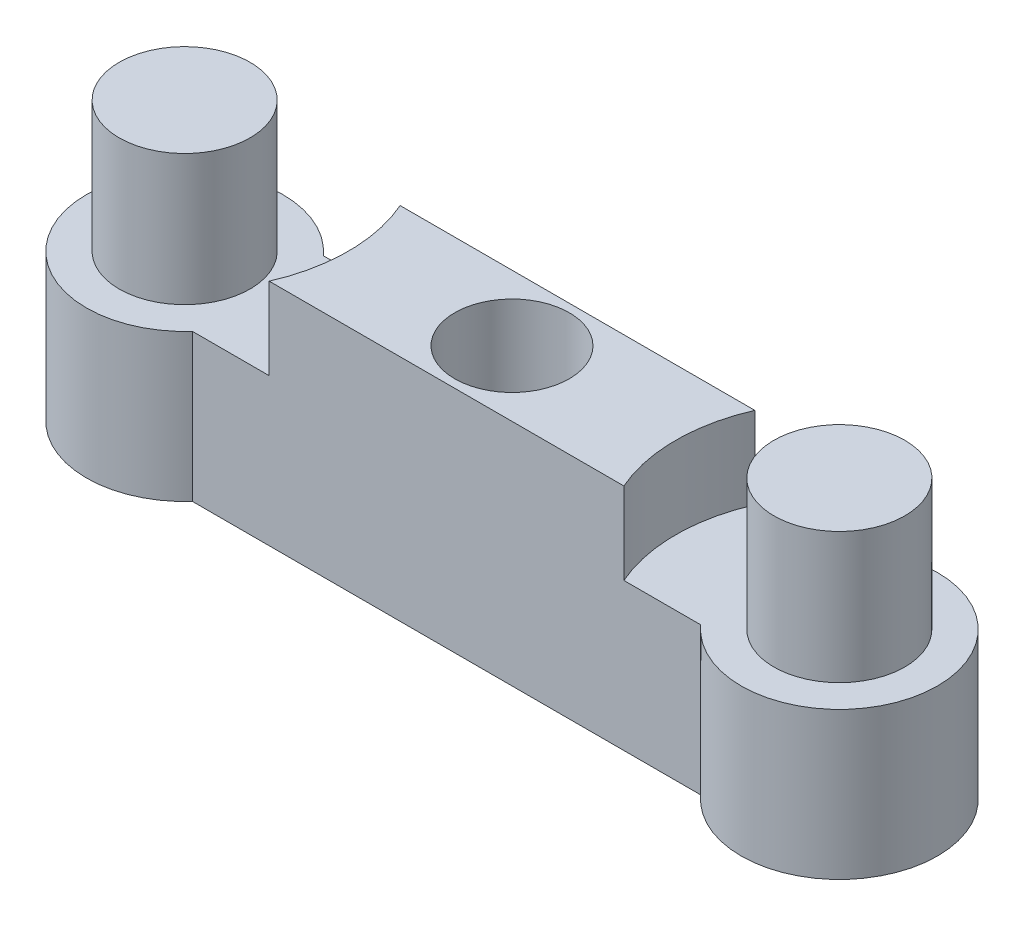
ISO-10303-21;
HEADER;
FILE_DESCRIPTION(('STEP AP214'),'2;1');
FILE_NAME('part.step','',(''),(''),'','','');
FILE_SCHEMA(('AUTOMOTIVE_DESIGN { 1 0 10303 214 1 1 1 1 }'));
ENDSEC;
DATA;
#1=APPLICATION_CONTEXT('core data for automotive mechanical design processes');
#2=APPLICATION_PROTOCOL_DEFINITION('international standard','automotive_design',2000,#1);
#3=PRODUCT_CONTEXT('',#1,'mechanical');
#4=PRODUCT('Part','Part','',(#3));
#5=PRODUCT_RELATED_PRODUCT_CATEGORY('part','',(#4));
#6=PRODUCT_DEFINITION_FORMATION('','',#4);
#7=PRODUCT_DEFINITION_CONTEXT('part definition',#1,'design');
#8=PRODUCT_DEFINITION('design','',#6,#7);
#9=PRODUCT_DEFINITION_SHAPE('','',#8);
#10=(LENGTH_UNIT() NAMED_UNIT(*) SI_UNIT(.MILLI.,.METRE.));
#11=(NAMED_UNIT(*) PLANE_ANGLE_UNIT() SI_UNIT($,.RADIAN.));
#12=(NAMED_UNIT(*) SI_UNIT($,.STERADIAN.) SOLID_ANGLE_UNIT());
#13=UNCERTAINTY_MEASURE_WITH_UNIT(LENGTH_MEASURE(1.E-05),#10,'distance_accuracy_value','');
#14=(GEOMETRIC_REPRESENTATION_CONTEXT(3) GLOBAL_UNCERTAINTY_ASSIGNED_CONTEXT((#13)) GLOBAL_UNIT_ASSIGNED_CONTEXT((#10,
#11,#12)) REPRESENTATION_CONTEXT('',''));
#15=CARTESIAN_POINT('',(0.,0.,0.));
#16=DIRECTION('',(0.,0.,1.));
#17=DIRECTION('',(1.,0.,0.));
#18=AXIS2_PLACEMENT_3D('',#15,#16,#17);
#19=CARTESIAN_POINT('',(7.76393202250021,9.,2.));
#20=DIRECTION('',(0.,0.,-1.));
#21=DIRECTION('',(-1.,0.,0.));
#22=AXIS2_PLACEMENT_3D('',#19,#20,#21);
#23=PLANE('',#22);
#24=DIRECTION('',(1.,0.,0.));
#25=VECTOR('',#24,1.);
#26=CARTESIAN_POINT('',(7.76393202250021,7.,2.));
#27=LINE('',#26,#25);
#28=CARTESIAN_POINT('',(-5.41742430504416,7.,2.));
#29=VERTEX_POINT('',#28);
#30=CARTESIAN_POINT('',(5.41742430504417,7.,2.));
#31=VERTEX_POINT('',#30);
#32=EDGE_CURVE('E105',#29,#31,#27,.T.);
#33=ORIENTED_EDGE('',*,*,#32,.F.);
#34=DIRECTION('',(0.,1.,0.));
#35=VECTOR('',#34,1.);
#36=CARTESIAN_POINT('',(-5.41742430504416,4.5,2.));
#37=LINE('',#36,#35);
#38=CARTESIAN_POINT('',(-5.41742430504416,4.5,2.));
#39=VERTEX_POINT('',#38);
#40=EDGE_CURVE('E114',#29,#39,#37,.F.);
#41=ORIENTED_EDGE('',*,*,#40,.T.);
#42=DIRECTION('',(1.,0.,0.));
#43=VECTOR('',#42,1.);
#44=CARTESIAN_POINT('',(7.76393202250021,4.5,2.));
#45=LINE('',#44,#43);
#46=CARTESIAN_POINT('',(-7.76393202250021,4.5,2.));
#47=VERTEX_POINT('',#46);
#48=EDGE_CURVE('E136',#47,#39,#45,.T.);
#49=ORIENTED_EDGE('',*,*,#48,.F.);
#50=DIRECTION('',(0.,-1.,0.));
#51=VECTOR('',#50,1.);
#52=CARTESIAN_POINT('',(-7.76393202250021,9.,2.));
#53=LINE('',#52,#51);
#54=CARTESIAN_POINT('',(-7.76393202250021,0.,2.));
#55=VERTEX_POINT('',#54);
#56=EDGE_CURVE('E153',#47,#55,#53,.T.);
#57=ORIENTED_EDGE('',*,*,#56,.T.);
#58=DIRECTION('',(1.,0.,0.));
#59=VECTOR('',#58,1.);
#60=CARTESIAN_POINT('',(7.76393202250021,0.,2.));
#61=LINE('',#60,#59);
#62=CARTESIAN_POINT('',(7.76393202250021,0.,2.));
#63=VERTEX_POINT('',#62);
#64=EDGE_CURVE('E140',#55,#63,#61,.T.);
#65=ORIENTED_EDGE('',*,*,#64,.T.);
#66=DIRECTION('',(0.,-1.,0.));
#67=VECTOR('',#66,1.);
#68=CARTESIAN_POINT('',(7.76393202250021,9.,2.));
#69=LINE('',#68,#67);
#70=CARTESIAN_POINT('',(7.76393202250021,4.5,2.));
#71=VERTEX_POINT('',#70);
#72=EDGE_CURVE('E151',#71,#63,#69,.T.);
#73=ORIENTED_EDGE('',*,*,#72,.F.);
#74=DIRECTION('',(-1.,0.,0.));
#75=VECTOR('',#74,1.);
#76=CARTESIAN_POINT('',(7.76393202250021,4.5,2.));
#77=LINE('',#76,#75);
#78=CARTESIAN_POINT('',(5.41742430504417,4.5,2.));
#79=VERTEX_POINT('',#78);
#80=EDGE_CURVE('E128',#71,#79,#77,.T.);
#81=ORIENTED_EDGE('',*,*,#80,.T.);
#82=DIRECTION('',(0.,1.,0.));
#83=VECTOR('',#82,1.);
#84=CARTESIAN_POINT('',(5.41742430504417,4.5,2.));
#85=LINE('',#84,#83);
#86=EDGE_CURVE('E117',#79,#31,#85,.T.);
#87=ORIENTED_EDGE('',*,*,#86,.T.);
#88=EDGE_LOOP('',(#33,#41,#49,#57,#65,#73,#81,#87));
#89=FACE_BOUND('',#88,.T.);
#90=ADVANCED_FACE('F36',(#89),#23,.F.);
#91=CARTESIAN_POINT('',(7.76393202250021,9.,-2.));
#92=DIRECTION('',(0.,0.,1.));
#93=DIRECTION('',(1.,0.,0.));
#94=AXIS2_PLACEMENT_3D('',#91,#92,#93);
#95=PLANE('',#94);
#96=DIRECTION('',(-1.,0.,0.));
#97=VECTOR('',#96,1.);
#98=CARTESIAN_POINT('',(7.76393202250021,7.,-2.));
#99=LINE('',#98,#97);
#100=CARTESIAN_POINT('',(5.41742430504416,7.,-2.));
#101=VERTEX_POINT('',#100);
#102=CARTESIAN_POINT('',(-5.41742430504416,7.,-2.));
#103=VERTEX_POINT('',#102);
#104=EDGE_CURVE('E53',#101,#103,#99,.T.);
#105=ORIENTED_EDGE('',*,*,#104,.F.);
#106=DIRECTION('',(0.,1.,0.));
#107=VECTOR('',#106,1.);
#108=CARTESIAN_POINT('',(5.41742430504416,4.5,-2.));
#109=LINE('',#108,#107);
#110=CARTESIAN_POINT('',(5.41742430504416,4.5,-2.));
#111=VERTEX_POINT('',#110);
#112=EDGE_CURVE('E183',#101,#111,#109,.F.);
#113=ORIENTED_EDGE('',*,*,#112,.T.);
#114=DIRECTION('',(1.,0.,0.));
#115=VECTOR('',#114,1.);
#116=CARTESIAN_POINT('',(7.76393202250021,4.5,-2.));
#117=LINE('',#116,#115);
#118=CARTESIAN_POINT('',(7.76393202250021,4.5,-2.));
#119=VERTEX_POINT('',#118);
#120=EDGE_CURVE('E155',#111,#119,#117,.T.);
#121=ORIENTED_EDGE('',*,*,#120,.T.);
#122=DIRECTION('',(0.,-1.,0.));
#123=VECTOR('',#122,1.);
#124=CARTESIAN_POINT('',(7.76393202250021,9.,-2.));
#125=LINE('',#124,#123);
#126=CARTESIAN_POINT('',(7.76393202250021,0.,-2.));
#127=VERTEX_POINT('',#126);
#128=EDGE_CURVE('E149',#119,#127,#125,.T.);
#129=ORIENTED_EDGE('',*,*,#128,.T.);
#130=DIRECTION('',(-1.,0.,0.));
#131=VECTOR('',#130,1.);
#132=CARTESIAN_POINT('',(7.76393202250021,0.,-2.));
#133=LINE('',#132,#131);
#134=CARTESIAN_POINT('',(-7.76393202250021,0.,-2.));
#135=VERTEX_POINT('',#134);
#136=EDGE_CURVE('E146',#127,#135,#133,.T.);
#137=ORIENTED_EDGE('',*,*,#136,.T.);
#138=DIRECTION('',(0.,-1.,0.));
#139=VECTOR('',#138,1.);
#140=CARTESIAN_POINT('',(-7.76393202250021,9.,-2.));
#141=LINE('',#140,#139);
#142=CARTESIAN_POINT('',(-7.76393202250021,4.5,-2.));
#143=VERTEX_POINT('',#142);
#144=EDGE_CURVE('E61',#143,#135,#141,.T.);
#145=ORIENTED_EDGE('',*,*,#144,.F.);
#146=DIRECTION('',(-1.,0.,0.));
#147=VECTOR('',#146,1.);
#148=CARTESIAN_POINT('',(7.76393202250021,4.5,-2.));
#149=LINE('',#148,#147);
#150=CARTESIAN_POINT('',(-5.41742430504416,4.5,-2.));
#151=VERTEX_POINT('',#150);
#152=EDGE_CURVE('E45',#151,#143,#149,.T.);
#153=ORIENTED_EDGE('',*,*,#152,.F.);
#154=DIRECTION('',(0.,1.,0.));
#155=VECTOR('',#154,1.);
#156=CARTESIAN_POINT('',(-5.41742430504416,4.5,-2.));
#157=LINE('',#156,#155);
#158=EDGE_CURVE('E125',#151,#103,#157,.T.);
#159=ORIENTED_EDGE('',*,*,#158,.T.);
#160=EDGE_LOOP('',(#105,#113,#121,#129,#137,#145,#153,#159));
#161=FACE_BOUND('',#160,.T.);
#162=ADVANCED_FACE('F189',(#161),#95,.F.);
#163=CARTESIAN_POINT('',(10.,4.5,0.));
#164=DIRECTION('',(0.,1.,0.));
#165=DIRECTION('',(0.,0.,1.));
#166=AXIS2_PLACEMENT_3D('',#163,#164,#165);
#167=CYLINDRICAL_SURFACE('',#166,5.);
#168=CARTESIAN_POINT('',(10.,7.,0.));
#169=DIRECTION('',(0.,1.,0.));
#170=DIRECTION('',(0.,0.,1.));
#171=AXIS2_PLACEMENT_3D('',#168,#169,#170);
#172=CIRCLE('',#171,5.);
#173=EDGE_CURVE('E118',#31,#101,#172,.F.);
#174=ORIENTED_EDGE('',*,*,#173,.F.);
#175=ORIENTED_EDGE('',*,*,#86,.F.);
#176=CARTESIAN_POINT('',(10.,4.5,0.));
#177=DIRECTION('',(0.,1.,0.));
#178=DIRECTION('',(0.,0.,-1.));
#179=AXIS2_PLACEMENT_3D('',#176,#177,#178);
#180=CIRCLE('',#179,5.);
#181=EDGE_CURVE('E179',#111,#79,#180,.T.);
#182=ORIENTED_EDGE('',*,*,#181,.F.);
#183=ORIENTED_EDGE('',*,*,#112,.F.);
#184=EDGE_LOOP('',(#174,#175,#182,#183));
#185=FACE_BOUND('',#184,.T.);
#186=ADVANCED_FACE('F195',(#185),#167,.F.);
#187=CARTESIAN_POINT('',(-10.,4.5,0.));
#188=DIRECTION('',(0.,1.,0.));
#189=DIRECTION('',(0.,0.,1.));
#190=AXIS2_PLACEMENT_3D('',#187,#188,#189);
#191=CYLINDRICAL_SURFACE('',#190,5.);
#192=CARTESIAN_POINT('',(-10.,7.,0.));
#193=DIRECTION('',(0.,1.,0.));
#194=DIRECTION('',(0.,0.,1.));
#195=AXIS2_PLACEMENT_3D('',#192,#193,#194);
#196=CIRCLE('',#195,5.);
#197=EDGE_CURVE('E102',#103,#29,#196,.F.);
#198=ORIENTED_EDGE('',*,*,#197,.F.);
#199=ORIENTED_EDGE('',*,*,#158,.F.);
#200=CARTESIAN_POINT('',(-10.,4.5,0.));
#201=DIRECTION('',(0.,1.,0.));
#202=DIRECTION('',(0.,0.,1.));
#203=AXIS2_PLACEMENT_3D('',#200,#201,#202);
#204=CIRCLE('',#203,5.);
#205=EDGE_CURVE('E123',#39,#151,#204,.T.);
#206=ORIENTED_EDGE('',*,*,#205,.F.);
#207=ORIENTED_EDGE('',*,*,#40,.F.);
#208=EDGE_LOOP('',(#198,#199,#206,#207));
#209=FACE_BOUND('',#208,.T.);
#210=ADVANCED_FACE('F121',(#209),#191,.F.);
#211=CARTESIAN_POINT('',(0.,2.,0.));
#212=DIRECTION('',(0.,1.,0.));
#213=DIRECTION('',(0.,0.,1.));
#214=AXIS2_PLACEMENT_3D('',#211,#212,#213);
#215=CYLINDRICAL_SURFACE('',#214,1.75);
#216=CARTESIAN_POINT('',(0.,2.,0.));
#217=DIRECTION('',(0.,1.,0.));
#218=DIRECTION('',(0.,0.,1.));
#219=AXIS2_PLACEMENT_3D('',#216,#217,#218);
#220=CIRCLE('',#219,1.75);
#221=CARTESIAN_POINT('',(0.,2.,1.75));
#222=VERTEX_POINT('',#221);
#223=EDGE_CURVE('E161',#222,#222,#220,.T.);
#224=ORIENTED_EDGE('',*,*,#223,.F.);
#225=EDGE_LOOP('',(#224));
#226=FACE_BOUND('',#225,.T.);
#227=CARTESIAN_POINT('',(0.,7.,0.));
#228=DIRECTION('',(0.,1.,0.));
#229=DIRECTION('',(0.,0.,1.));
#230=AXIS2_PLACEMENT_3D('',#227,#228,#229);
#231=CIRCLE('',#230,1.75);
#232=CARTESIAN_POINT('',(0.,7.,1.75));
#233=VERTEX_POINT('',#232);
#234=EDGE_CURVE('E40',#233,#233,#231,.F.);
#235=ORIENTED_EDGE('',*,*,#234,.F.);
#236=EDGE_LOOP('',(#235));
#237=FACE_BOUND('',#236,.T.);
#238=ADVANCED_FACE('F202',(#226,#237),#215,.F.);
#239=CARTESIAN_POINT('',(0.,0.,0.));
#240=DIRECTION('',(0.,1.,0.));
#241=DIRECTION('',(0.,0.,1.));
#242=AXIS2_PLACEMENT_3D('',#239,#240,#241);
#243=CYLINDRICAL_SURFACE('',#242,1.);
#244=CARTESIAN_POINT('',(0.,0.,0.));
#245=DIRECTION('',(0.,1.,0.));
#246=DIRECTION('',(0.,0.,1.));
#247=AXIS2_PLACEMENT_3D('',#244,#245,#246);
#248=CIRCLE('',#247,1.);
#249=CARTESIAN_POINT('',(0.,0.,1.));
#250=VERTEX_POINT('',#249);
#251=EDGE_CURVE('E160',#250,#250,#248,.T.);
#252=ORIENTED_EDGE('',*,*,#251,.F.);
#253=EDGE_LOOP('',(#252));
#254=FACE_BOUND('',#253,.T.);
#255=CARTESIAN_POINT('',(0.,2.,0.));
#256=DIRECTION('',(0.,1.,0.));
#257=DIRECTION('',(0.,0.,1.));
#258=AXIS2_PLACEMENT_3D('',#255,#256,#257);
#259=CIRCLE('',#258,1.);
#260=CARTESIAN_POINT('',(0.,2.,1.));
#261=VERTEX_POINT('',#260);
#262=EDGE_CURVE('E158',#261,#261,#259,.F.);
#263=ORIENTED_EDGE('',*,*,#262,.F.);
#264=EDGE_LOOP('',(#263));
#265=FACE_BOUND('',#264,.T.);
#266=ADVANCED_FACE('F256',(#254,#265),#243,.F.);
#267=CARTESIAN_POINT('',(-10.,9.,0.));
#268=DIRECTION('',(0.,-1.,0.));
#269=DIRECTION('',(0.,0.,-1.));
#270=AXIS2_PLACEMENT_3D('',#267,#268,#269);
#271=CYLINDRICAL_SURFACE('',#270,3.);
#272=CARTESIAN_POINT('',(-10.,4.5,0.));
#273=DIRECTION('',(0.,1.,0.));
#274=DIRECTION('',(0.,0.,1.));
#275=AXIS2_PLACEMENT_3D('',#272,#273,#274);
#276=CIRCLE('',#275,3.);
#277=EDGE_CURVE('E134',#143,#47,#276,.T.);
#278=ORIENTED_EDGE('',*,*,#277,.F.);
#279=ORIENTED_EDGE('',*,*,#144,.T.);
#280=CARTESIAN_POINT('',(-10.,0.,0.));
#281=DIRECTION('',(0.,1.,0.));
#282=DIRECTION('',(0.,0.,1.));
#283=AXIS2_PLACEMENT_3D('',#280,#281,#282);
#284=CIRCLE('',#283,3.);
#285=EDGE_CURVE('E138',#135,#55,#284,.T.);
#286=ORIENTED_EDGE('',*,*,#285,.T.);
#287=ORIENTED_EDGE('',*,*,#56,.F.);
#288=EDGE_LOOP('',(#278,#279,#286,#287));
#289=FACE_BOUND('',#288,.T.);
#290=ADVANCED_FACE('F38',(#289),#271,.T.);
#291=CARTESIAN_POINT('',(10.,9.,0.));
#292=DIRECTION('',(0.,-1.,0.));
#293=DIRECTION('',(0.,0.,-1.));
#294=AXIS2_PLACEMENT_3D('',#291,#292,#293);
#295=CYLINDRICAL_SURFACE('',#294,3.);
#296=ORIENTED_EDGE('',*,*,#128,.F.);
#297=CARTESIAN_POINT('',(10.,4.5,0.));
#298=DIRECTION('',(0.,-1.,0.));
#299=DIRECTION('',(0.,0.,-1.));
#300=AXIS2_PLACEMENT_3D('',#297,#298,#299);
#301=CIRCLE('',#300,3.);
#302=EDGE_CURVE('E124',#119,#71,#301,.T.);
#303=ORIENTED_EDGE('',*,*,#302,.T.);
#304=ORIENTED_EDGE('',*,*,#72,.T.);
#305=CARTESIAN_POINT('',(10.,0.,0.));
#306=DIRECTION('',(0.,1.,0.));
#307=DIRECTION('',(0.,0.,-1.));
#308=AXIS2_PLACEMENT_3D('',#305,#306,#307);
#309=CIRCLE('',#308,3.);
#310=EDGE_CURVE('E143',#63,#127,#309,.T.);
#311=ORIENTED_EDGE('',*,*,#310,.T.);
#312=EDGE_LOOP('',(#296,#303,#304,#311));
#313=FACE_BOUND('',#312,.T.);
#314=ADVANCED_FACE('F211',(#313),#295,.T.);
#315=CARTESIAN_POINT('',(-10.,0.,0.));
#316=DIRECTION('',(0.,1.,0.));
#317=DIRECTION('',(0.,0.,1.));
#318=AXIS2_PLACEMENT_3D('',#315,#316,#317);
#319=PLANE('',#318);
#320=ORIENTED_EDGE('',*,*,#251,.T.);
#321=EDGE_LOOP('',(#320));
#322=FACE_BOUND('',#321,.T.);
#323=ORIENTED_EDGE('',*,*,#285,.F.);
#324=ORIENTED_EDGE('',*,*,#136,.F.);
#325=ORIENTED_EDGE('',*,*,#310,.F.);
#326=ORIENTED_EDGE('',*,*,#64,.F.);
#327=EDGE_LOOP('',(#323,#324,#325,#326));
#328=FACE_BOUND('',#327,.T.);
#329=ADVANCED_FACE('F213',(#322,#328),#319,.F.);
#330=CARTESIAN_POINT('',(10.,4.5,0.));
#331=DIRECTION('',(0.,-1.,0.));
#332=DIRECTION('',(0.,0.,-1.));
#333=AXIS2_PLACEMENT_3D('',#330,#331,#332);
#334=PLANE('',#333);
#335=CARTESIAN_POINT('',(10.,4.5,0.));
#336=DIRECTION('',(0.,-1.,0.));
#337=DIRECTION('',(0.,0.,-1.));
#338=AXIS2_PLACEMENT_3D('',#335,#336,#337);
#339=CIRCLE('',#338,2.);
#340=CARTESIAN_POINT('',(10.,4.5,-2.));
#341=VERTEX_POINT('',#340);
#342=EDGE_CURVE('E11',#341,#341,#339,.F.);
#343=ORIENTED_EDGE('',*,*,#342,.F.);
#344=EDGE_LOOP('',(#343));
#345=FACE_BOUND('',#344,.T.);
#346=ORIENTED_EDGE('',*,*,#302,.F.);
#347=ORIENTED_EDGE('',*,*,#120,.F.);
#348=ORIENTED_EDGE('',*,*,#181,.T.);
#349=ORIENTED_EDGE('',*,*,#80,.F.);
#350=EDGE_LOOP('',(#346,#347,#348,#349));
#351=FACE_BOUND('',#350,.T.);
#352=ADVANCED_FACE('F194',(#345,#351),#334,.F.);
#353=CARTESIAN_POINT('',(-10.,4.5,0.));
#354=DIRECTION('',(0.,1.,0.));
#355=DIRECTION('',(0.,0.,1.));
#356=AXIS2_PLACEMENT_3D('',#353,#354,#355);
#357=PLANE('',#356);
#358=CARTESIAN_POINT('',(-10.,4.5,0.));
#359=DIRECTION('',(0.,1.,0.));
#360=DIRECTION('',(0.,0.,1.));
#361=AXIS2_PLACEMENT_3D('',#358,#359,#360);
#362=CIRCLE('',#361,2.);
#363=CARTESIAN_POINT('',(-10.,4.5,2.));
#364=VERTEX_POINT('',#363);
#365=EDGE_CURVE('E175',#364,#364,#362,.T.);
#366=ORIENTED_EDGE('',*,*,#365,.F.);
#367=EDGE_LOOP('',(#366));
#368=FACE_BOUND('',#367,.T.);
#369=ORIENTED_EDGE('',*,*,#48,.T.);
#370=ORIENTED_EDGE('',*,*,#205,.T.);
#371=ORIENTED_EDGE('',*,*,#152,.T.);
#372=ORIENTED_EDGE('',*,*,#277,.T.);
#373=EDGE_LOOP('',(#369,#370,#371,#372));
#374=FACE_BOUND('',#373,.T.);
#375=ADVANCED_FACE('F220',(#368,#374),#357,.T.);
#376=CARTESIAN_POINT('',(-10.,8.5,0.));
#377=DIRECTION('',(0.,-1.,0.));
#378=DIRECTION('',(0.,0.,-1.));
#379=AXIS2_PLACEMENT_3D('',#376,#377,#378);
#380=CYLINDRICAL_SURFACE('',#379,2.);
#381=CARTESIAN_POINT('',(-10.,8.5,0.));
#382=DIRECTION('',(0.,1.,0.));
#383=DIRECTION('',(0.,0.,1.));
#384=AXIS2_PLACEMENT_3D('',#381,#382,#383);
#385=CIRCLE('',#384,2.);
#386=CARTESIAN_POINT('',(-10.,8.5,2.));
#387=VERTEX_POINT('',#386);
#388=EDGE_CURVE('E176',#387,#387,#385,.T.);
#389=ORIENTED_EDGE('',*,*,#388,.F.);
#390=EDGE_LOOP('',(#389));
#391=FACE_BOUND('',#390,.T.);
#392=ORIENTED_EDGE('',*,*,#365,.T.);
#393=EDGE_LOOP('',(#392));
#394=FACE_BOUND('',#393,.T.);
#395=ADVANCED_FACE('F233',(#391,#394),#380,.T.);
#396=CARTESIAN_POINT('',(-10.,8.5,0.));
#397=DIRECTION('',(0.,1.,0.));
#398=DIRECTION('',(0.,0.,1.));
#399=AXIS2_PLACEMENT_3D('',#396,#397,#398);
#400=PLANE('',#399);
#401=ORIENTED_EDGE('',*,*,#388,.T.);
#402=EDGE_LOOP('',(#401));
#403=FACE_BOUND('',#402,.T.);
#404=ADVANCED_FACE('F239',(#403),#400,.T.);
#405=CARTESIAN_POINT('',(10.,8.5,0.));
#406=DIRECTION('',(0.,-1.,0.));
#407=DIRECTION('',(0.,0.,-1.));
#408=AXIS2_PLACEMENT_3D('',#405,#406,#407);
#409=CYLINDRICAL_SURFACE('',#408,2.);
#410=CARTESIAN_POINT('',(10.,8.5,0.));
#411=DIRECTION('',(0.,1.,0.));
#412=DIRECTION('',(0.,0.,-1.));
#413=AXIS2_PLACEMENT_3D('',#410,#411,#412);
#414=CIRCLE('',#413,2.);
#415=CARTESIAN_POINT('',(10.,8.5,-2.));
#416=VERTEX_POINT('',#415);
#417=EDGE_CURVE('E165',#416,#416,#414,.T.);
#418=ORIENTED_EDGE('',*,*,#417,.F.);
#419=EDGE_LOOP('',(#418));
#420=FACE_BOUND('',#419,.T.);
#421=ORIENTED_EDGE('',*,*,#342,.T.);
#422=EDGE_LOOP('',(#421));
#423=FACE_BOUND('',#422,.T.);
#424=ADVANCED_FACE('F246',(#420,#423),#409,.T.);
#425=CARTESIAN_POINT('',(10.,8.5,0.));
#426=DIRECTION('',(0.,-1.,0.));
#427=DIRECTION('',(0.,0.,-1.));
#428=AXIS2_PLACEMENT_3D('',#425,#426,#427);
#429=PLANE('',#428);
#430=ORIENTED_EDGE('',*,*,#417,.T.);
#431=EDGE_LOOP('',(#430));
#432=FACE_BOUND('',#431,.T.);
#433=ADVANCED_FACE('F250',(#432),#429,.F.);
#434=CARTESIAN_POINT('',(0.,2.,0.));
#435=DIRECTION('',(0.,1.,0.));
#436=DIRECTION('',(0.,0.,1.));
#437=AXIS2_PLACEMENT_3D('',#434,#435,#436);
#438=PLANE('',#437);
#439=ORIENTED_EDGE('',*,*,#223,.T.);
#440=EDGE_LOOP('',(#439));
#441=FACE_BOUND('',#440,.T.);
#442=ORIENTED_EDGE('',*,*,#262,.T.);
#443=EDGE_LOOP('',(#442));
#444=FACE_BOUND('',#443,.T.);
#445=ADVANCED_FACE('F254',(#441,#444),#438,.T.);
#446=CARTESIAN_POINT('',(0.,7.,0.));
#447=DIRECTION('',(0.,1.,0.));
#448=DIRECTION('',(0.,0.,1.));
#449=AXIS2_PLACEMENT_3D('',#446,#447,#448);
#450=PLANE('',#449);
#451=ORIENTED_EDGE('',*,*,#234,.T.);
#452=EDGE_LOOP('',(#451));
#453=FACE_BOUND('',#452,.T.);
#454=ORIENTED_EDGE('',*,*,#173,.T.);
#455=ORIENTED_EDGE('',*,*,#104,.T.);
#456=ORIENTED_EDGE('',*,*,#197,.T.);
#457=ORIENTED_EDGE('',*,*,#32,.T.);
#458=EDGE_LOOP('',(#454,#455,#456,#457));
#459=FACE_BOUND('',#458,.T.);
#460=ADVANCED_FACE('F104',(#453,#459),#450,.T.);
#461=CLOSED_SHELL('',(#90,#162,#186,#210,#238,#266,#290,#314,#329,#352,#375,#395,#404,#424,#433,
#445,#460));
#462=MANIFOLD_SOLID_BREP('B2',#461);
#463=ADVANCED_BREP_SHAPE_REPRESENTATION('',(#18,#462),#14);
#464=SHAPE_DEFINITION_REPRESENTATION(#9,#463);
ENDSEC;
END-ISO-10303-21;
